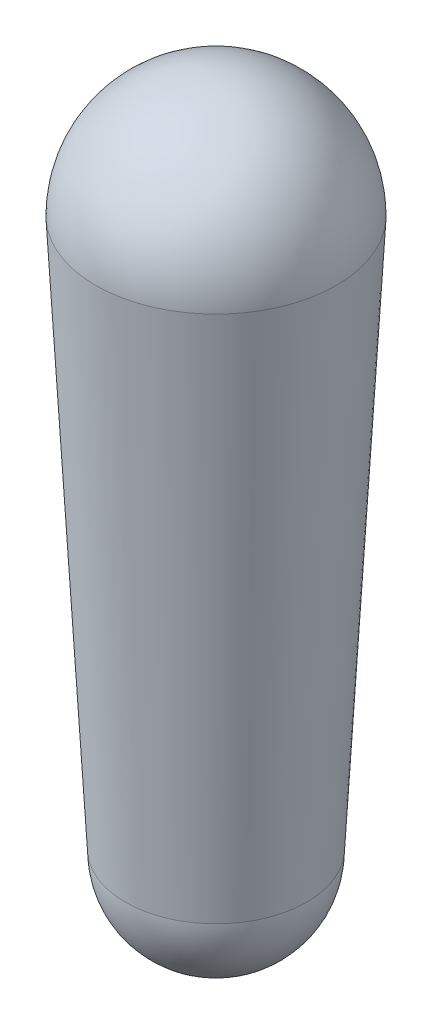
ISO-10303-21;
HEADER;
FILE_DESCRIPTION(('STEP AP214'),'2;1');
FILE_NAME('part.step','',(''),(''),'','','');
FILE_SCHEMA(('AUTOMOTIVE_DESIGN { 1 0 10303 214 1 1 1 1 }'));
ENDSEC;
DATA;
#1=APPLICATION_CONTEXT('core data for automotive mechanical design processes');
#2=APPLICATION_PROTOCOL_DEFINITION('international standard','automotive_design',2000,#1);
#3=PRODUCT_CONTEXT('',#1,'mechanical');
#4=PRODUCT('Part','Part','',(#3));
#5=PRODUCT_RELATED_PRODUCT_CATEGORY('part','',(#4));
#6=PRODUCT_DEFINITION_FORMATION('','',#4);
#7=PRODUCT_DEFINITION_CONTEXT('part definition',#1,'design');
#8=PRODUCT_DEFINITION('design','',#6,#7);
#9=PRODUCT_DEFINITION_SHAPE('','',#8);
#10=(LENGTH_UNIT() NAMED_UNIT(*) SI_UNIT(.MILLI.,.METRE.));
#11=(NAMED_UNIT(*) PLANE_ANGLE_UNIT() SI_UNIT($,.RADIAN.));
#12=(NAMED_UNIT(*) SI_UNIT($,.STERADIAN.) SOLID_ANGLE_UNIT());
#13=UNCERTAINTY_MEASURE_WITH_UNIT(LENGTH_MEASURE(1.E-05),#10,'distance_accuracy_value','');
#14=(GEOMETRIC_REPRESENTATION_CONTEXT(3) GLOBAL_UNCERTAINTY_ASSIGNED_CONTEXT((#13)) GLOBAL_UNIT_ASSIGNED_CONTEXT((#10,
#11,#12)) REPRESENTATION_CONTEXT('',''));
#15=CARTESIAN_POINT('',(0.,0.,0.));
#16=DIRECTION('',(0.,0.,1.));
#17=DIRECTION('',(1.,0.,0.));
#18=AXIS2_PLACEMENT_3D('',#15,#16,#17);
#19=CARTESIAN_POINT('',(0.,-415.036,0.));
#20=DIRECTION('',(0.,1.,0.));
#21=DIRECTION('',(0.,0.,1.));
#22=AXIS2_PLACEMENT_3D('',#19,#20,#21);
#23=CONICAL_SURFACE('',#22,68.7236218590137,0.0535203682265193);
#24=CARTESIAN_POINT('',(0.,0.,0.));
#25=DIRECTION('',(0.,1.,0.));
#26=DIRECTION('',(0.,0.,1.));
#27=AXIS2_PLACEMENT_3D('',#24,#25,#26);
#28=CIRCLE('',#27,90.9577348134006);
#29=CARTESIAN_POINT('',(0.,0.,90.9577348134006));
#30=VERTEX_POINT('',#29);
#31=EDGE_CURVE('E10',#30,#30,#28,.T.);
#32=ORIENTED_EDGE('',*,*,#31,.F.);
#33=EDGE_LOOP('',(#32));
#34=FACE_BOUND('',#33,.T.);
#35=CARTESIAN_POINT('',(0.,-415.036,0.));
#36=DIRECTION('',(0.,1.,0.));
#37=DIRECTION('',(0.,0.,1.));
#38=AXIS2_PLACEMENT_3D('',#35,#36,#37);
#39=CIRCLE('',#38,68.7236218590138);
#40=CARTESIAN_POINT('',(0.,-415.036,68.7236218590138));
#41=VERTEX_POINT('',#40);
#42=EDGE_CURVE('E42',#41,#41,#39,.T.);
#43=ORIENTED_EDGE('',*,*,#42,.T.);
#44=EDGE_LOOP('',(#43));
#45=FACE_BOUND('',#44,.T.);
#46=ADVANCED_FACE('F36',(#34,#45),#23,.T.);
#47=CARTESIAN_POINT('',(0.,-415.036,0.));
#48=DIRECTION('',(0.,1.,0.));
#49=DIRECTION('',(0.,0.,1.));
#50=AXIS2_PLACEMENT_3D('',#47,#48,#49);
#51=SPHERICAL_SURFACE('',#50,68.7236218590138);
#52=ORIENTED_EDGE('',*,*,#42,.F.);
#53=EDGE_LOOP('',(#52));
#54=FACE_BOUND('',#53,.T.);
#55=ADVANCED_FACE('F49',(#54),#51,.T.);
#56=CARTESIAN_POINT('',(0.,0.,0.));
#57=DIRECTION('',(0.,1.,0.));
#58=DIRECTION('',(0.,0.,-1.));
#59=AXIS2_PLACEMENT_3D('',#56,#57,#58);
#60=SPHERICAL_SURFACE('',#59,90.9577348134006);
#61=ORIENTED_EDGE('',*,*,#31,.T.);
#62=EDGE_LOOP('',(#61));
#63=FACE_BOUND('',#62,.T.);
#64=ADVANCED_FACE('F51',(#63),#60,.T.);
#65=CLOSED_SHELL('',(#46,#55,#64));
#66=MANIFOLD_SOLID_BREP('B2',#65);
#67=ADVANCED_BREP_SHAPE_REPRESENTATION('',(#18,#66),#14);
#68=SHAPE_DEFINITION_REPRESENTATION(#9,#67);
ENDSEC;
END-ISO-10303-21;
